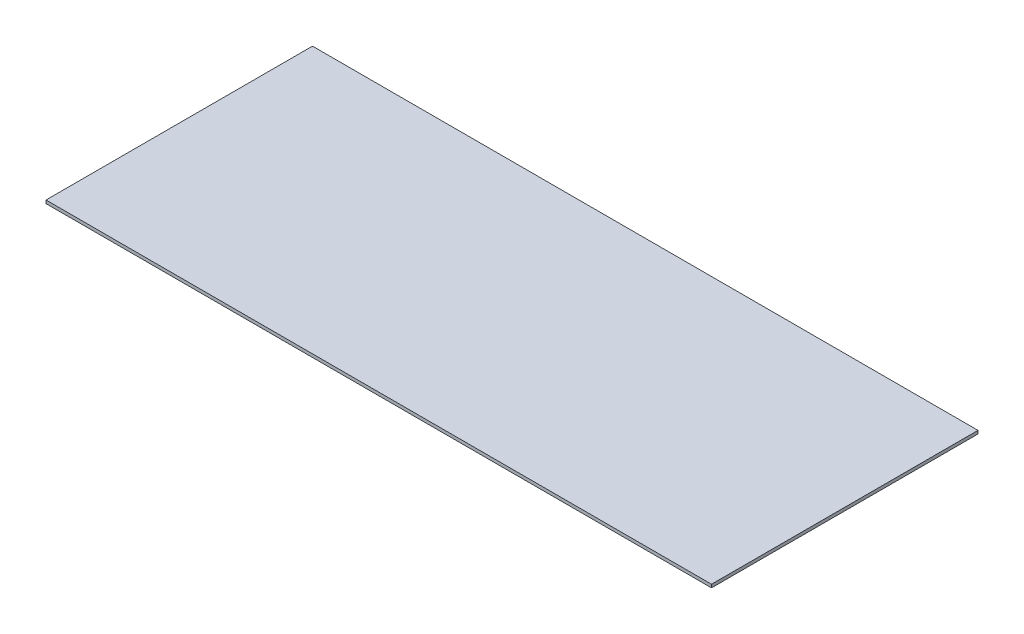
ISO-10303-21;
HEADER;
FILE_DESCRIPTION(('STEP AP214'),'2;1');
FILE_NAME('part.step','',(''),(''),'','','');
FILE_SCHEMA(('AUTOMOTIVE_DESIGN { 1 0 10303 214 1 1 1 1 }'));
ENDSEC;
DATA;
#1=APPLICATION_CONTEXT('core data for automotive mechanical design processes');
#2=APPLICATION_PROTOCOL_DEFINITION('international standard','automotive_design',2000,#1);
#3=PRODUCT_CONTEXT('',#1,'mechanical');
#4=PRODUCT('Part','Part','',(#3));
#5=PRODUCT_RELATED_PRODUCT_CATEGORY('part','',(#4));
#6=PRODUCT_DEFINITION_FORMATION('','',#4);
#7=PRODUCT_DEFINITION_CONTEXT('part definition',#1,'design');
#8=PRODUCT_DEFINITION('design','',#6,#7);
#9=PRODUCT_DEFINITION_SHAPE('','',#8);
#10=(LENGTH_UNIT() NAMED_UNIT(*) SI_UNIT(.MILLI.,.METRE.));
#11=(NAMED_UNIT(*) PLANE_ANGLE_UNIT() SI_UNIT($,.RADIAN.));
#12=(NAMED_UNIT(*) SI_UNIT($,.STERADIAN.) SOLID_ANGLE_UNIT());
#13=UNCERTAINTY_MEASURE_WITH_UNIT(LENGTH_MEASURE(1.E-05),#10,'distance_accuracy_value','');
#14=(GEOMETRIC_REPRESENTATION_CONTEXT(3) GLOBAL_UNCERTAINTY_ASSIGNED_CONTEXT((#13)) GLOBAL_UNIT_ASSIGNED_CONTEXT((#10,
#11,#12)) REPRESENTATION_CONTEXT('',''));
#15=CARTESIAN_POINT('',(0.,0.,0.));
#16=DIRECTION('',(0.,0.,1.));
#17=DIRECTION('',(1.,0.,0.));
#18=AXIS2_PLACEMENT_3D('',#15,#16,#17);
#19=CARTESIAN_POINT('',(0.,-6348.26697018121,0.));
#20=DIRECTION('',(-1.,0.,0.));
#21=DIRECTION('',(0.,0.,1.));
#22=AXIS2_PLACEMENT_3D('',#19,#20,#21);
#23=PLANE('',#22);
#24=DIRECTION('',(0.,0.,-1.));
#25=VECTOR('',#24,1.);
#26=CARTESIAN_POINT('',(0.,-27.9400000000001,0.));
#27=LINE('',#26,#25);
#28=CARTESIAN_POINT('',(0.,-27.9400000000001,0.));
#29=VERTEX_POINT('',#28);
#30=CARTESIAN_POINT('',(0.,-27.9400000000001,-2349.5));
#31=VERTEX_POINT('',#30);
#32=EDGE_CURVE('E44',#29,#31,#27,.T.);
#33=ORIENTED_EDGE('',*,*,#32,.F.);
#34=DIRECTION('',(0.,1.,0.));
#35=VECTOR('',#34,1.);
#36=CARTESIAN_POINT('',(0.,-6348.26697018121,0.));
#37=LINE('',#36,#35);
#38=CARTESIAN_POINT('',(0.,0.,0.));
#39=VERTEX_POINT('',#38);
#40=EDGE_CURVE('E72',#29,#39,#37,.T.);
#41=ORIENTED_EDGE('',*,*,#40,.T.);
#42=DIRECTION('',(0.,0.,1.));
#43=VECTOR('',#42,1.);
#44=CARTESIAN_POINT('',(0.,0.,0.));
#45=LINE('',#44,#43);
#46=CARTESIAN_POINT('',(0.,0.,-2349.5));
#47=VERTEX_POINT('',#46);
#48=EDGE_CURVE('E76',#47,#39,#45,.T.);
#49=ORIENTED_EDGE('',*,*,#48,.F.);
#50=DIRECTION('',(0.,1.,0.));
#51=VECTOR('',#50,1.);
#52=CARTESIAN_POINT('',(0.,-6348.26697018121,-2349.5));
#53=LINE('',#52,#51);
#54=EDGE_CURVE('E99',#31,#47,#53,.T.);
#55=ORIENTED_EDGE('',*,*,#54,.F.);
#56=EDGE_LOOP('',(#33,#41,#49,#55));
#57=FACE_BOUND('',#56,.T.);
#58=ADVANCED_FACE('F36',(#57),#23,.T.);
#59=CARTESIAN_POINT('',(0.,-6348.26697018121,-2349.5));
#60=DIRECTION('',(0.,0.,-1.));
#61=DIRECTION('',(-1.,0.,0.));
#62=AXIS2_PLACEMENT_3D('',#59,#60,#61);
#63=PLANE('',#62);
#64=DIRECTION('',(1.,0.,0.));
#65=VECTOR('',#64,1.);
#66=CARTESIAN_POINT('',(0.,-27.9400000000001,-2349.5));
#67=LINE('',#66,#65);
#68=CARTESIAN_POINT('',(5867.4,-27.9400000000001,-2349.5));
#69=VERTEX_POINT('',#68);
#70=EDGE_CURVE('E50',#31,#69,#67,.T.);
#71=ORIENTED_EDGE('',*,*,#70,.F.);
#72=ORIENTED_EDGE('',*,*,#54,.T.);
#73=DIRECTION('',(-1.,0.,0.));
#74=VECTOR('',#73,1.);
#75=CARTESIAN_POINT('',(0.,0.,-2349.5));
#76=LINE('',#75,#74);
#77=CARTESIAN_POINT('',(5867.4,0.,-2349.5));
#78=VERTEX_POINT('',#77);
#79=EDGE_CURVE('E81',#78,#47,#76,.T.);
#80=ORIENTED_EDGE('',*,*,#79,.F.);
#81=DIRECTION('',(0.,1.,0.));
#82=VECTOR('',#81,1.);
#83=CARTESIAN_POINT('',(5867.4,-6348.26697018121,-2349.5));
#84=LINE('',#83,#82);
#85=EDGE_CURVE('E102',#69,#78,#84,.T.);
#86=ORIENTED_EDGE('',*,*,#85,.F.);
#87=EDGE_LOOP('',(#71,#72,#80,#86));
#88=FACE_BOUND('',#87,.T.);
#89=ADVANCED_FACE('F108',(#88),#63,.T.);
#90=CARTESIAN_POINT('',(5867.4,-6348.26697018121,0.));
#91=DIRECTION('',(1.,0.,0.));
#92=DIRECTION('',(0.,0.,-1.));
#93=AXIS2_PLACEMENT_3D('',#90,#91,#92);
#94=PLANE('',#93);
#95=DIRECTION('',(0.,0.,1.));
#96=VECTOR('',#95,1.);
#97=CARTESIAN_POINT('',(5867.4,-27.9400000000001,0.));
#98=LINE('',#97,#96);
#99=CARTESIAN_POINT('',(5867.4,-27.9400000000001,0.));
#100=VERTEX_POINT('',#99);
#101=EDGE_CURVE('E101',#69,#100,#98,.T.);
#102=ORIENTED_EDGE('',*,*,#101,.F.);
#103=ORIENTED_EDGE('',*,*,#85,.T.);
#104=DIRECTION('',(0.,0.,-1.));
#105=VECTOR('',#104,1.);
#106=CARTESIAN_POINT('',(5867.4,0.,0.));
#107=LINE('',#106,#105);
#108=CARTESIAN_POINT('',(5867.4,0.,0.));
#109=VERTEX_POINT('',#108);
#110=EDGE_CURVE('E89',#109,#78,#107,.T.);
#111=ORIENTED_EDGE('',*,*,#110,.F.);
#112=DIRECTION('',(0.,1.,0.));
#113=VECTOR('',#112,1.);
#114=CARTESIAN_POINT('',(5867.4,-6348.26697018121,0.));
#115=LINE('',#114,#113);
#116=EDGE_CURVE('E80',#100,#109,#115,.T.);
#117=ORIENTED_EDGE('',*,*,#116,.F.);
#118=EDGE_LOOP('',(#102,#103,#111,#117));
#119=FACE_BOUND('',#118,.T.);
#120=ADVANCED_FACE('F106',(#119),#94,.T.);
#121=CARTESIAN_POINT('',(0.,-6348.26697018121,0.));
#122=DIRECTION('',(0.,0.,1.));
#123=DIRECTION('',(1.,0.,0.));
#124=AXIS2_PLACEMENT_3D('',#121,#122,#123);
#125=PLANE('',#124);
#126=DIRECTION('',(-1.,0.,0.));
#127=VECTOR('',#126,1.);
#128=CARTESIAN_POINT('',(0.,-27.9400000000001,0.));
#129=LINE('',#128,#127);
#130=EDGE_CURVE('E11',#100,#29,#129,.T.);
#131=ORIENTED_EDGE('',*,*,#130,.F.);
#132=ORIENTED_EDGE('',*,*,#116,.T.);
#133=DIRECTION('',(1.,0.,0.));
#134=VECTOR('',#133,1.);
#135=CARTESIAN_POINT('',(0.,0.,0.));
#136=LINE('',#135,#134);
#137=EDGE_CURVE('E83',#39,#109,#136,.T.);
#138=ORIENTED_EDGE('',*,*,#137,.F.);
#139=ORIENTED_EDGE('',*,*,#40,.F.);
#140=EDGE_LOOP('',(#131,#132,#138,#139));
#141=FACE_BOUND('',#140,.T.);
#142=ADVANCED_FACE('F84',(#141),#125,.T.);
#143=CARTESIAN_POINT('',(0.,0.,0.));
#144=DIRECTION('',(0.,-1.,0.));
#145=DIRECTION('',(0.,0.,-1.));
#146=AXIS2_PLACEMENT_3D('',#143,#144,#145);
#147=PLANE('',#146);
#148=ORIENTED_EDGE('',*,*,#48,.T.);
#149=ORIENTED_EDGE('',*,*,#137,.T.);
#150=ORIENTED_EDGE('',*,*,#110,.T.);
#151=ORIENTED_EDGE('',*,*,#79,.T.);
#152=EDGE_LOOP('',(#148,#149,#150,#151));
#153=FACE_BOUND('',#152,.T.);
#154=ADVANCED_FACE('F91',(#153),#147,.F.);
#155=CARTESIAN_POINT('',(0.,-27.94,0.));
#156=DIRECTION('',(0.,1.,0.));
#157=DIRECTION('',(0.,0.,1.));
#158=AXIS2_PLACEMENT_3D('',#155,#156,#157);
#159=PLANE('',#158);
#160=ORIENTED_EDGE('',*,*,#32,.T.);
#161=ORIENTED_EDGE('',*,*,#70,.T.);
#162=ORIENTED_EDGE('',*,*,#101,.T.);
#163=ORIENTED_EDGE('',*,*,#130,.T.);
#164=EDGE_LOOP('',(#160,#161,#162,#163));
#165=FACE_BOUND('',#164,.T.);
#166=ADVANCED_FACE('F110',(#165),#159,.F.);
#167=CLOSED_SHELL('',(#58,#89,#120,#142,#154,#166));
#168=MANIFOLD_SOLID_BREP('B2',#167);
#169=ADVANCED_BREP_SHAPE_REPRESENTATION('',(#18,#168),#14);
#170=SHAPE_DEFINITION_REPRESENTATION(#9,#169);
ENDSEC;
END-ISO-10303-21;
